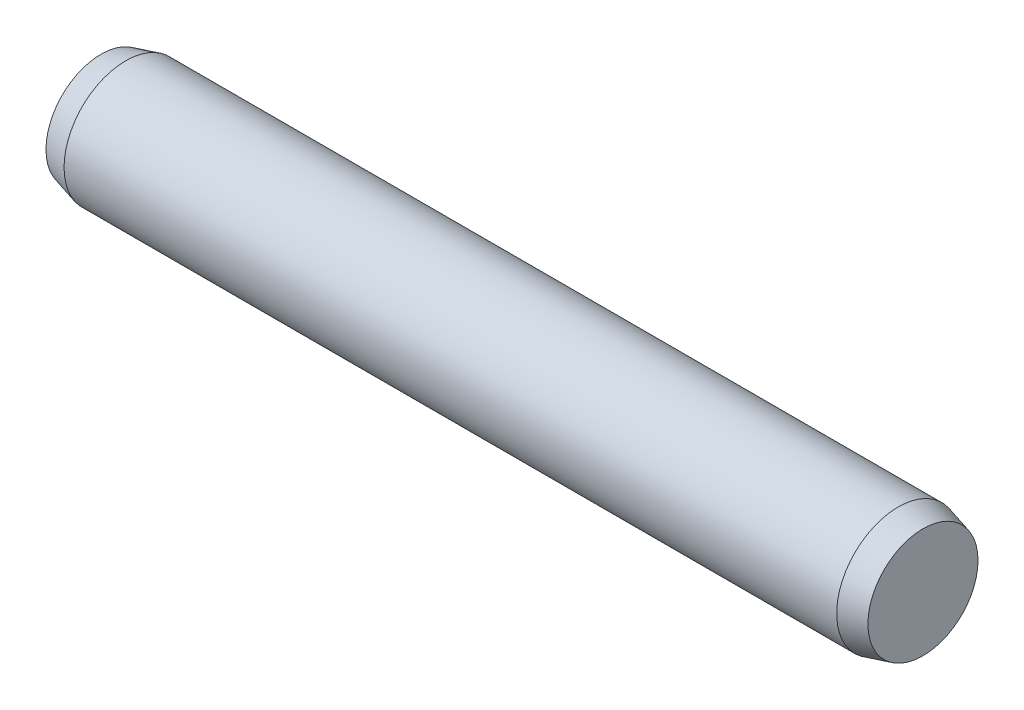
ISO-10303-21;
HEADER;
FILE_DESCRIPTION(('STEP AP214'),'2;1');
FILE_NAME('part.step','',(''),(''),'','','');
FILE_SCHEMA(('AUTOMOTIVE_DESIGN { 1 0 10303 214 1 1 1 1 }'));
ENDSEC;
DATA;
#1=APPLICATION_CONTEXT('core data for automotive mechanical design processes');
#2=APPLICATION_PROTOCOL_DEFINITION('international standard','automotive_design',2000,#1);
#3=PRODUCT_CONTEXT('',#1,'mechanical');
#4=PRODUCT('Part','Part','',(#3));
#5=PRODUCT_RELATED_PRODUCT_CATEGORY('part','',(#4));
#6=PRODUCT_DEFINITION_FORMATION('','',#4);
#7=PRODUCT_DEFINITION_CONTEXT('part definition',#1,'design');
#8=PRODUCT_DEFINITION('design','',#6,#7);
#9=PRODUCT_DEFINITION_SHAPE('','',#8);
#10=(LENGTH_UNIT() NAMED_UNIT(*) SI_UNIT(.MILLI.,.METRE.));
#11=(NAMED_UNIT(*) PLANE_ANGLE_UNIT() SI_UNIT($,.RADIAN.));
#12=(NAMED_UNIT(*) SI_UNIT($,.STERADIAN.) SOLID_ANGLE_UNIT());
#13=UNCERTAINTY_MEASURE_WITH_UNIT(LENGTH_MEASURE(1.E-05),#10,'distance_accuracy_value','');
#14=(GEOMETRIC_REPRESENTATION_CONTEXT(3) GLOBAL_UNCERTAINTY_ASSIGNED_CONTEXT((#13)) GLOBAL_UNIT_ASSIGNED_CONTEXT((#10,
#11,#12)) REPRESENTATION_CONTEXT('',''));
#15=CARTESIAN_POINT('',(0.,0.,0.));
#16=DIRECTION('',(0.,0.,1.));
#17=DIRECTION('',(1.,0.,0.));
#18=AXIS2_PLACEMENT_3D('',#15,#16,#17);
#19=CARTESIAN_POINT('',(-18.8,0.,0.));
#20=DIRECTION('',(1.,0.,0.));
#21=DIRECTION('',(0.,0.,-1.));
#22=AXIS2_PLACEMENT_3D('',#19,#20,#21);
#23=CYLINDRICAL_SURFACE('',#22,3.);
#24=CARTESIAN_POINT('',(-18.8,0.,0.));
#25=DIRECTION('',(-1.,0.,0.));
#26=DIRECTION('',(0.,0.,1.));
#27=AXIS2_PLACEMENT_3D('',#24,#25,#26);
#28=CIRCLE('',#27,3.);
#29=CARTESIAN_POINT('',(-18.8,0.,3.));
#30=VERTEX_POINT('',#29);
#31=EDGE_CURVE('E48',#30,#30,#28,.T.);
#32=ORIENTED_EDGE('',*,*,#31,.F.);
#33=EDGE_LOOP('',(#32));
#34=FACE_BOUND('',#33,.T.);
#35=CARTESIAN_POINT('',(18.8,0.,0.));
#36=DIRECTION('',(1.,0.,0.));
#37=DIRECTION('',(0.,0.,-1.));
#38=AXIS2_PLACEMENT_3D('',#35,#36,#37);
#39=CIRCLE('',#38,3.);
#40=CARTESIAN_POINT('',(18.8,0.,-3.));
#41=VERTEX_POINT('',#40);
#42=EDGE_CURVE('E10',#41,#41,#39,.T.);
#43=ORIENTED_EDGE('',*,*,#42,.F.);
#44=EDGE_LOOP('',(#43));
#45=FACE_BOUND('',#44,.T.);
#46=ADVANCED_FACE('F34',(#34,#45),#23,.T.);
#47=CARTESIAN_POINT('',(18.8,0.,0.));
#48=DIRECTION('',(-1.,0.,0.));
#49=DIRECTION('',(0.,0.,-1.));
#50=AXIS2_PLACEMENT_3D('',#47,#48,#49);
#51=CONICAL_SURFACE('',#50,3.,0.26179938779915);
#52=CARTESIAN_POINT('',(20.,0.,0.));
#53=DIRECTION('',(1.,0.,0.));
#54=DIRECTION('',(0.,0.,-1.));
#55=AXIS2_PLACEMENT_3D('',#52,#53,#54);
#56=CIRCLE('',#55,2.67846096908265);
#57=CARTESIAN_POINT('',(20.,0.,-2.67846096908265));
#58=VERTEX_POINT('',#57);
#59=EDGE_CURVE('E40',#58,#58,#56,.T.);
#60=ORIENTED_EDGE('',*,*,#59,.F.);
#61=EDGE_LOOP('',(#60));
#62=FACE_BOUND('',#61,.T.);
#63=ORIENTED_EDGE('',*,*,#42,.T.);
#64=EDGE_LOOP('',(#63));
#65=FACE_BOUND('',#64,.T.);
#66=ADVANCED_FACE('F58',(#62,#65),#51,.T.);
#67=CARTESIAN_POINT('',(20.,0.,0.));
#68=DIRECTION('',(1.,0.,0.));
#69=DIRECTION('',(0.,0.,-1.));
#70=AXIS2_PLACEMENT_3D('',#67,#68,#69);
#71=PLANE('',#70);
#72=ORIENTED_EDGE('',*,*,#59,.T.);
#73=EDGE_LOOP('',(#72));
#74=FACE_BOUND('',#73,.T.);
#75=ADVANCED_FACE('F62',(#74),#71,.T.);
#76=CARTESIAN_POINT('',(-18.8,0.,0.));
#77=DIRECTION('',(1.,0.,0.));
#78=DIRECTION('',(0.,0.,1.));
#79=AXIS2_PLACEMENT_3D('',#76,#77,#78);
#80=CONICAL_SURFACE('',#79,3.,0.26179938779915);
#81=CARTESIAN_POINT('',(-20.,0.,0.));
#82=DIRECTION('',(-1.,0.,0.));
#83=DIRECTION('',(0.,0.,1.));
#84=AXIS2_PLACEMENT_3D('',#81,#82,#83);
#85=CIRCLE('',#84,2.67846096908265);
#86=CARTESIAN_POINT('',(-20.,0.,2.67846096908265));
#87=VERTEX_POINT('',#86);
#88=EDGE_CURVE('E44',#87,#87,#85,.T.);
#89=ORIENTED_EDGE('',*,*,#88,.F.);
#90=EDGE_LOOP('',(#89));
#91=FACE_BOUND('',#90,.T.);
#92=ORIENTED_EDGE('',*,*,#31,.T.);
#93=EDGE_LOOP('',(#92));
#94=FACE_BOUND('',#93,.T.);
#95=ADVANCED_FACE('F54',(#91,#94),#80,.T.);
#96=CARTESIAN_POINT('',(-20.,0.,0.));
#97=DIRECTION('',(-1.,0.,0.));
#98=DIRECTION('',(0.,0.,1.));
#99=AXIS2_PLACEMENT_3D('',#96,#97,#98);
#100=PLANE('',#99);
#101=ORIENTED_EDGE('',*,*,#88,.T.);
#102=EDGE_LOOP('',(#101));
#103=FACE_BOUND('',#102,.T.);
#104=ADVANCED_FACE('F71',(#103),#100,.T.);
#105=CLOSED_SHELL('',(#46,#66,#75,#95,#104));
#106=MANIFOLD_SOLID_BREP('B2',#105);
#107=ADVANCED_BREP_SHAPE_REPRESENTATION('',(#18,#106),#14);
#108=SHAPE_DEFINITION_REPRESENTATION(#9,#107);
ENDSEC;
END-ISO-10303-21;
